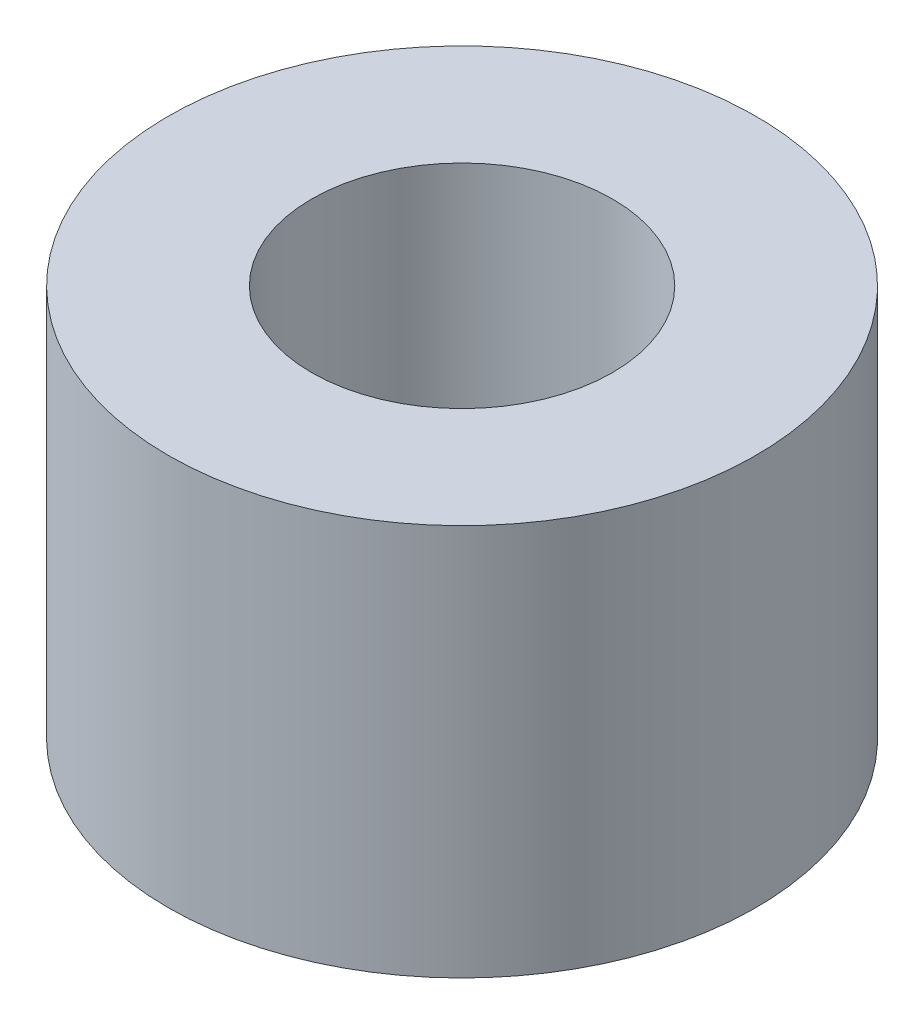
ISO-10303-21;
HEADER;
FILE_DESCRIPTION(('STEP AP214'),'2;1');
FILE_NAME('part.step','',(''),(''),'','','');
FILE_SCHEMA(('AUTOMOTIVE_DESIGN { 1 0 10303 214 1 1 1 1 }'));
ENDSEC;
DATA;
#1=APPLICATION_CONTEXT('core data for automotive mechanical design processes');
#2=APPLICATION_PROTOCOL_DEFINITION('international standard','automotive_design',2000,#1);
#3=PRODUCT_CONTEXT('',#1,'mechanical');
#4=PRODUCT('Part','Part','',(#3));
#5=PRODUCT_RELATED_PRODUCT_CATEGORY('part','',(#4));
#6=PRODUCT_DEFINITION_FORMATION('','',#4);
#7=PRODUCT_DEFINITION_CONTEXT('part definition',#1,'design');
#8=PRODUCT_DEFINITION('design','',#6,#7);
#9=PRODUCT_DEFINITION_SHAPE('','',#8);
#10=(LENGTH_UNIT() NAMED_UNIT(*) SI_UNIT(.MILLI.,.METRE.));
#11=(NAMED_UNIT(*) PLANE_ANGLE_UNIT() SI_UNIT($,.RADIAN.));
#12=(NAMED_UNIT(*) SI_UNIT($,.STERADIAN.) SOLID_ANGLE_UNIT());
#13=UNCERTAINTY_MEASURE_WITH_UNIT(LENGTH_MEASURE(1.E-05),#10,'distance_accuracy_value','');
#14=(GEOMETRIC_REPRESENTATION_CONTEXT(3) GLOBAL_UNCERTAINTY_ASSIGNED_CONTEXT((#13)) GLOBAL_UNIT_ASSIGNED_CONTEXT((#10,
#11,#12)) REPRESENTATION_CONTEXT('',''));
#15=CARTESIAN_POINT('',(0.,0.,0.));
#16=DIRECTION('',(0.,0.,1.));
#17=DIRECTION('',(1.,0.,0.));
#18=AXIS2_PLACEMENT_3D('',#15,#16,#17);
#19=CARTESIAN_POINT('',(0.,0.,0.));
#20=DIRECTION('',(0.,1.,0.));
#21=DIRECTION('',(0.,0.,1.));
#22=AXIS2_PLACEMENT_3D('',#19,#20,#21);
#23=CYLINDRICAL_SURFACE('',#22,2.4384);
#24=CARTESIAN_POINT('',(0.,6.35,0.));
#25=DIRECTION('',(0.,1.,0.));
#26=DIRECTION('',(0.,0.,1.));
#27=AXIS2_PLACEMENT_3D('',#24,#25,#26);
#28=CIRCLE('',#27,2.4384);
#29=CARTESIAN_POINT('',(0.,6.35,2.4384));
#30=VERTEX_POINT('',#29);
#31=EDGE_CURVE('E18',#30,#30,#28,.F.);
#32=ORIENTED_EDGE('',*,*,#31,.F.);
#33=EDGE_LOOP('',(#32));
#34=FACE_BOUND('',#33,.T.);
#35=CARTESIAN_POINT('',(0.,0.,0.));
#36=DIRECTION('',(0.,1.,0.));
#37=DIRECTION('',(0.,0.,1.));
#38=AXIS2_PLACEMENT_3D('',#35,#36,#37);
#39=CIRCLE('',#38,2.4384);
#40=CARTESIAN_POINT('',(0.,0.,2.4384));
#41=VERTEX_POINT('',#40);
#42=EDGE_CURVE('E31',#41,#41,#39,.F.);
#43=ORIENTED_EDGE('',*,*,#42,.T.);
#44=EDGE_LOOP('',(#43));
#45=FACE_BOUND('',#44,.T.);
#46=ADVANCED_FACE('F15',(#34,#45),#23,.F.);
#47=CARTESIAN_POINT('',(0.,6.35,0.));
#48=DIRECTION('',(0.,1.,0.));
#49=DIRECTION('',(0.,0.,1.));
#50=AXIS2_PLACEMENT_3D('',#47,#48,#49);
#51=PLANE('',#50);
#52=ORIENTED_EDGE('',*,*,#31,.T.);
#53=EDGE_LOOP('',(#52));
#54=FACE_BOUND('',#53,.T.);
#55=CARTESIAN_POINT('',(0.,6.35,0.));
#56=DIRECTION('',(0.,1.,0.));
#57=DIRECTION('',(0.,0.,1.));
#58=AXIS2_PLACEMENT_3D('',#55,#56,#57);
#59=CIRCLE('',#58,4.7625);
#60=CARTESIAN_POINT('',(0.,6.35,4.7625));
#61=VERTEX_POINT('',#60);
#62=EDGE_CURVE('E23',#61,#61,#59,.F.);
#63=ORIENTED_EDGE('',*,*,#62,.F.);
#64=EDGE_LOOP('',(#63));
#65=FACE_BOUND('',#64,.T.);
#66=ADVANCED_FACE('F40',(#54,#65),#51,.T.);
#67=CARTESIAN_POINT('',(0.,0.,0.));
#68=DIRECTION('',(0.,1.,0.));
#69=DIRECTION('',(0.,0.,1.));
#70=AXIS2_PLACEMENT_3D('',#67,#68,#69);
#71=PLANE('',#70);
#72=ORIENTED_EDGE('',*,*,#42,.F.);
#73=EDGE_LOOP('',(#72));
#74=FACE_BOUND('',#73,.T.);
#75=CARTESIAN_POINT('',(0.,0.,0.));
#76=DIRECTION('',(0.,1.,0.));
#77=DIRECTION('',(0.,0.,1.));
#78=AXIS2_PLACEMENT_3D('',#75,#76,#77);
#79=CIRCLE('',#78,4.7625);
#80=CARTESIAN_POINT('',(0.,0.,4.7625));
#81=VERTEX_POINT('',#80);
#82=EDGE_CURVE('E10',#81,#81,#79,.T.);
#83=ORIENTED_EDGE('',*,*,#82,.F.);
#84=EDGE_LOOP('',(#83));
#85=FACE_BOUND('',#84,.T.);
#86=ADVANCED_FACE('F48',(#74,#85),#71,.F.);
#87=CARTESIAN_POINT('',(0.,0.,0.));
#88=DIRECTION('',(0.,1.,0.));
#89=DIRECTION('',(0.,0.,1.));
#90=AXIS2_PLACEMENT_3D('',#87,#88,#89);
#91=CYLINDRICAL_SURFACE('',#90,4.7625);
#92=ORIENTED_EDGE('',*,*,#62,.T.);
#93=EDGE_LOOP('',(#92));
#94=FACE_BOUND('',#93,.T.);
#95=ORIENTED_EDGE('',*,*,#82,.T.);
#96=EDGE_LOOP('',(#95));
#97=FACE_BOUND('',#96,.T.);
#98=ADVANCED_FACE('F49',(#94,#97),#91,.T.);
#99=CLOSED_SHELL('',(#46,#66,#86,#98));
#100=MANIFOLD_SOLID_BREP('B1',#99);
#101=ADVANCED_BREP_SHAPE_REPRESENTATION('',(#18,#100),#14);
#102=SHAPE_DEFINITION_REPRESENTATION(#9,#101);
ENDSEC;
END-ISO-10303-21;
